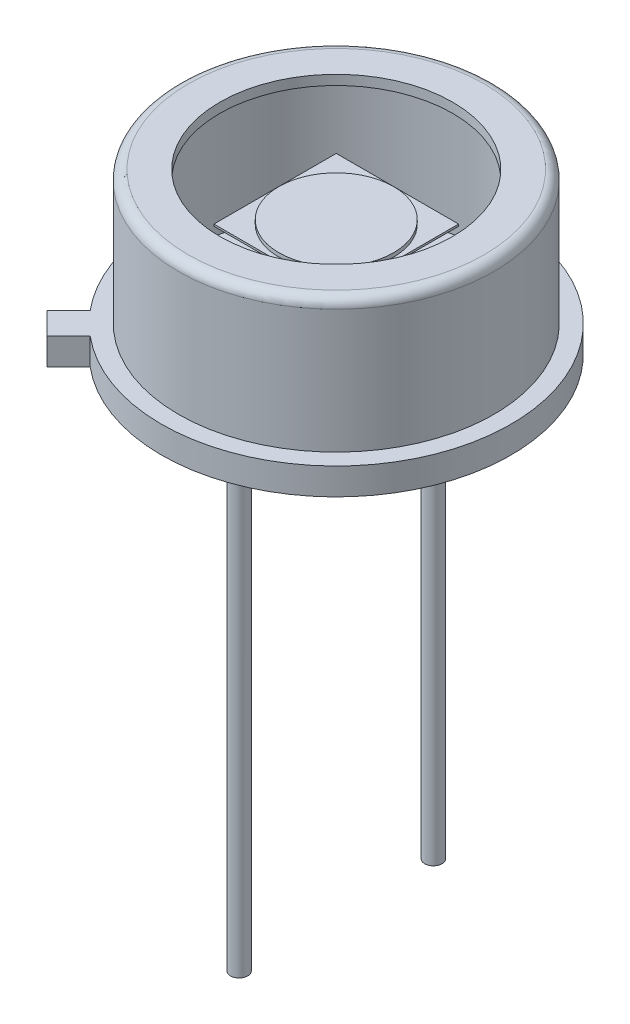
ISO-10303-21;
HEADER;
FILE_DESCRIPTION(('STEP AP214'),'2;1');
FILE_NAME('part.step','',(''),(''),'','','');
FILE_SCHEMA(('AUTOMOTIVE_DESIGN { 1 0 10303 214 1 1 1 1 }'));
ENDSEC;
DATA;
#1=APPLICATION_CONTEXT('core data for automotive mechanical design processes');
#2=APPLICATION_PROTOCOL_DEFINITION('international standard','automotive_design',2000,#1);
#3=PRODUCT_CONTEXT('',#1,'mechanical');
#4=PRODUCT('Part','Part','',(#3));
#5=PRODUCT_RELATED_PRODUCT_CATEGORY('part','',(#4));
#6=PRODUCT_DEFINITION_FORMATION('','',#4);
#7=PRODUCT_DEFINITION_CONTEXT('part definition',#1,'design');
#8=PRODUCT_DEFINITION('design','',#6,#7);
#9=PRODUCT_DEFINITION_SHAPE('','',#8);
#10=(LENGTH_UNIT() NAMED_UNIT(*) SI_UNIT(.MILLI.,.METRE.));
#11=(NAMED_UNIT(*) PLANE_ANGLE_UNIT() SI_UNIT($,.RADIAN.));
#12=(NAMED_UNIT(*) SI_UNIT($,.STERADIAN.) SOLID_ANGLE_UNIT());
#13=UNCERTAINTY_MEASURE_WITH_UNIT(LENGTH_MEASURE(1.E-05),#10,'distance_accuracy_value','');
#14=(GEOMETRIC_REPRESENTATION_CONTEXT(3) GLOBAL_UNCERTAINTY_ASSIGNED_CONTEXT((#13)) GLOBAL_UNIT_ASSIGNED_CONTEXT((#10,
#11,#12)) REPRESENTATION_CONTEXT('',''));
#15=CARTESIAN_POINT('',(0.,0.,0.));
#16=DIRECTION('',(0.,0.,1.));
#17=DIRECTION('',(1.,0.,0.));
#18=AXIS2_PLACEMENT_3D('',#15,#16,#17);
#19=CARTESIAN_POINT('',(-1.6,2.95,-1.6));
#20=DIRECTION('',(0.,-1.,0.));
#21=DIRECTION('',(0.,0.,-1.));
#22=AXIS2_PLACEMENT_3D('',#19,#20,#21);
#23=PLANE('',#22);
#24=DIRECTION('',(0.,0.,-1.));
#25=VECTOR('',#24,1.);
#26=CARTESIAN_POINT('',(-1.6,2.95,1.6));
#27=LINE('',#26,#25);
#28=CARTESIAN_POINT('',(-1.6,2.95,1.6));
#29=VERTEX_POINT('',#28);
#30=CARTESIAN_POINT('',(-1.6,2.95,-1.6));
#31=VERTEX_POINT('',#30);
#32=EDGE_CURVE('E114',#29,#31,#27,.T.);
#33=ORIENTED_EDGE('',*,*,#32,.F.);
#34=DIRECTION('',(-1.,0.,0.));
#35=VECTOR('',#34,1.);
#36=CARTESIAN_POINT('',(-1.6,2.95,1.6));
#37=LINE('',#36,#35);
#38=CARTESIAN_POINT('',(1.6,2.95,1.6));
#39=VERTEX_POINT('',#38);
#40=EDGE_CURVE('E87',#39,#29,#37,.T.);
#41=ORIENTED_EDGE('',*,*,#40,.F.);
#42=DIRECTION('',(0.,0.,1.));
#43=VECTOR('',#42,1.);
#44=CARTESIAN_POINT('',(1.6,2.95,1.6));
#45=LINE('',#44,#43);
#46=CARTESIAN_POINT('',(1.6,2.95,-1.6));
#47=VERTEX_POINT('',#46);
#48=EDGE_CURVE('E81',#47,#39,#45,.T.);
#49=ORIENTED_EDGE('',*,*,#48,.F.);
#50=DIRECTION('',(1.,0.,0.));
#51=VECTOR('',#50,1.);
#52=CARTESIAN_POINT('',(-1.6,2.95,-1.6));
#53=LINE('',#52,#51);
#54=EDGE_CURVE('E105',#31,#47,#53,.T.);
#55=ORIENTED_EDGE('',*,*,#54,.F.);
#56=EDGE_LOOP('',(#33,#41,#49,#55));
#57=FACE_BOUND('',#56,.T.);
#58=CARTESIAN_POINT('',(0.,2.95,0.));
#59=DIRECTION('',(0.,-1.,0.));
#60=DIRECTION('',(0.,0.,-1.));
#61=AXIS2_PLACEMENT_3D('',#58,#59,#60);
#62=CIRCLE('',#61,1.5);
#63=CARTESIAN_POINT('',(0.,2.95,-1.5));
#64=VERTEX_POINT('',#63);
#65=EDGE_CURVE('E12',#64,#64,#62,.F.);
#66=ORIENTED_EDGE('',*,*,#65,.F.);
#67=EDGE_LOOP('',(#66));
#68=FACE_BOUND('',#67,.T.);
#69=ADVANCED_FACE('F47',(#57,#68),#23,.F.);
#70=CARTESIAN_POINT('',(-1.6,2.9,1.6));
#71=DIRECTION('',(1.,0.,0.));
#72=DIRECTION('',(0.,0.,-1.));
#73=AXIS2_PLACEMENT_3D('',#70,#71,#72);
#74=PLANE('',#73);
#75=ORIENTED_EDGE('',*,*,#32,.T.);
#76=DIRECTION('',(0.,1.,0.));
#77=VECTOR('',#76,1.);
#78=CARTESIAN_POINT('',(-1.6,2.9,-1.6));
#79=LINE('',#78,#77);
#80=CARTESIAN_POINT('',(-1.6,2.9,-1.6));
#81=VERTEX_POINT('',#80);
#82=EDGE_CURVE('E56',#81,#31,#79,.T.);
#83=ORIENTED_EDGE('',*,*,#82,.F.);
#84=DIRECTION('',(0.,0.,-1.));
#85=VECTOR('',#84,1.);
#86=CARTESIAN_POINT('',(-1.6,2.9,1.6));
#87=LINE('',#86,#85);
#88=CARTESIAN_POINT('',(-1.6,2.9,1.6));
#89=VERTEX_POINT('',#88);
#90=EDGE_CURVE('E100',#89,#81,#87,.T.);
#91=ORIENTED_EDGE('',*,*,#90,.F.);
#92=DIRECTION('',(0.,1.,0.));
#93=VECTOR('',#92,1.);
#94=CARTESIAN_POINT('',(-1.6,2.9,1.6));
#95=LINE('',#94,#93);
#96=EDGE_CURVE('E110',#89,#29,#95,.T.);
#97=ORIENTED_EDGE('',*,*,#96,.T.);
#98=EDGE_LOOP('',(#75,#83,#91,#97));
#99=FACE_BOUND('',#98,.T.);
#100=ADVANCED_FACE('F49',(#99),#74,.F.);
#101=CARTESIAN_POINT('',(-1.6,2.9,-1.6));
#102=DIRECTION('',(0.,0.,1.));
#103=DIRECTION('',(1.,0.,0.));
#104=AXIS2_PLACEMENT_3D('',#101,#102,#103);
#105=PLANE('',#104);
#106=ORIENTED_EDGE('',*,*,#54,.T.);
#107=DIRECTION('',(0.,1.,0.));
#108=VECTOR('',#107,1.);
#109=CARTESIAN_POINT('',(1.6,2.9,-1.6));
#110=LINE('',#109,#108);
#111=CARTESIAN_POINT('',(1.6,2.9,-1.6));
#112=VERTEX_POINT('',#111);
#113=EDGE_CURVE('E103',#112,#47,#110,.T.);
#114=ORIENTED_EDGE('',*,*,#113,.F.);
#115=DIRECTION('',(1.,0.,0.));
#116=VECTOR('',#115,1.);
#117=CARTESIAN_POINT('',(-1.6,2.9,-1.6));
#118=LINE('',#117,#116);
#119=EDGE_CURVE('E95',#81,#112,#118,.T.);
#120=ORIENTED_EDGE('',*,*,#119,.F.);
#121=ORIENTED_EDGE('',*,*,#82,.T.);
#122=EDGE_LOOP('',(#106,#114,#120,#121));
#123=FACE_BOUND('',#122,.T.);
#124=ADVANCED_FACE('F104',(#123),#105,.F.);
#125=CARTESIAN_POINT('',(1.6,2.9,1.6));
#126=DIRECTION('',(-1.,0.,0.));
#127=DIRECTION('',(0.,0.,1.));
#128=AXIS2_PLACEMENT_3D('',#125,#126,#127);
#129=PLANE('',#128);
#130=ORIENTED_EDGE('',*,*,#48,.T.);
#131=DIRECTION('',(0.,1.,0.));
#132=VECTOR('',#131,1.);
#133=CARTESIAN_POINT('',(1.6,2.9,1.6));
#134=LINE('',#133,#132);
#135=CARTESIAN_POINT('',(1.6,2.9,1.6));
#136=VERTEX_POINT('',#135);
#137=EDGE_CURVE('E106',#136,#39,#134,.T.);
#138=ORIENTED_EDGE('',*,*,#137,.F.);
#139=DIRECTION('',(0.,0.,1.));
#140=VECTOR('',#139,1.);
#141=CARTESIAN_POINT('',(1.6,2.9,1.6));
#142=LINE('',#141,#140);
#143=EDGE_CURVE('E98',#112,#136,#142,.T.);
#144=ORIENTED_EDGE('',*,*,#143,.F.);
#145=ORIENTED_EDGE('',*,*,#113,.T.);
#146=EDGE_LOOP('',(#130,#138,#144,#145));
#147=FACE_BOUND('',#146,.T.);
#148=ADVANCED_FACE('F108',(#147),#129,.F.);
#149=CARTESIAN_POINT('',(-1.6,2.9,1.6));
#150=DIRECTION('',(0.,0.,-1.));
#151=DIRECTION('',(-1.,0.,0.));
#152=AXIS2_PLACEMENT_3D('',#149,#150,#151);
#153=PLANE('',#152);
#154=ORIENTED_EDGE('',*,*,#40,.T.);
#155=ORIENTED_EDGE('',*,*,#96,.F.);
#156=DIRECTION('',(-1.,0.,0.));
#157=VECTOR('',#156,1.);
#158=CARTESIAN_POINT('',(-1.6,2.9,1.6));
#159=LINE('',#158,#157);
#160=EDGE_CURVE('E64',#136,#89,#159,.T.);
#161=ORIENTED_EDGE('',*,*,#160,.F.);
#162=ORIENTED_EDGE('',*,*,#137,.T.);
#163=EDGE_LOOP('',(#154,#155,#161,#162));
#164=FACE_BOUND('',#163,.T.);
#165=ADVANCED_FACE('F141',(#164),#153,.F.);
#166=CARTESIAN_POINT('',(-1.6,2.9,-1.6));
#167=DIRECTION('',(0.,-1.,0.));
#168=DIRECTION('',(0.,0.,-1.));
#169=AXIS2_PLACEMENT_3D('',#166,#167,#168);
#170=PLANE('',#169);
#171=ORIENTED_EDGE('',*,*,#90,.T.);
#172=ORIENTED_EDGE('',*,*,#119,.T.);
#173=ORIENTED_EDGE('',*,*,#143,.T.);
#174=ORIENTED_EDGE('',*,*,#160,.T.);
#175=EDGE_LOOP('',(#171,#172,#173,#174));
#176=FACE_BOUND('',#175,.T.);
#177=ADVANCED_FACE('F96',(#176),#170,.T.);
#178=CARTESIAN_POINT('',(0.,3.05,0.));
#179=DIRECTION('',(0.,-1.,0.));
#180=DIRECTION('',(0.,0.,-1.));
#181=AXIS2_PLACEMENT_3D('',#178,#179,#180);
#182=CYLINDRICAL_SURFACE('',#181,1.5);
#183=CARTESIAN_POINT('',(0.,3.05,0.));
#184=DIRECTION('',(0.,1.,0.));
#185=DIRECTION('',(0.,0.,1.));
#186=AXIS2_PLACEMENT_3D('',#183,#184,#185);
#187=CIRCLE('',#186,1.5);
#188=CARTESIAN_POINT('',(0.,3.05,1.5));
#189=VERTEX_POINT('',#188);
#190=EDGE_CURVE('E117',#189,#189,#187,.T.);
#191=ORIENTED_EDGE('',*,*,#190,.F.);
#192=EDGE_LOOP('',(#191));
#193=FACE_BOUND('',#192,.T.);
#194=ORIENTED_EDGE('',*,*,#65,.T.);
#195=EDGE_LOOP('',(#194));
#196=FACE_BOUND('',#195,.T.);
#197=ADVANCED_FACE('F130',(#193,#196),#182,.T.);
#198=CARTESIAN_POINT('',(0.,3.05,0.));
#199=DIRECTION('',(0.,1.,0.));
#200=DIRECTION('',(0.,0.,1.));
#201=AXIS2_PLACEMENT_3D('',#198,#199,#200);
#202=PLANE('',#201);
#203=ORIENTED_EDGE('',*,*,#190,.T.);
#204=EDGE_LOOP('',(#203));
#205=FACE_BOUND('',#204,.T.);
#206=ADVANCED_FACE('F132',(#205),#202,.T.);
#207=CLOSED_SHELL('',(#69,#100,#124,#148,#165,#177,#197,#206));
#208=MANIFOLD_SOLID_BREP('B2',#207);
#209=CARTESIAN_POINT('',(4.57,0.,0.));
#210=DIRECTION('',(0.,1.,0.));
#211=DIRECTION('',(0.,0.,1.));
#212=AXIS2_PLACEMENT_3D('',#209,#210,#211);
#213=PLANE('',#212);
#214=CARTESIAN_POINT('',(0.,0.,2.54));
#215=DIRECTION('',(0.,1.,0.));
#216=DIRECTION('',(0.,0.,1.));
#217=AXIS2_PLACEMENT_3D('',#214,#215,#216);
#218=CIRCLE('',#217,0.225000000000001);
#219=CARTESIAN_POINT('',(0.,0.,2.765));
#220=VERTEX_POINT('',#219);
#221=EDGE_CURVE('E211',#220,#220,#218,.F.);
#222=ORIENTED_EDGE('',*,*,#221,.F.);
#223=EDGE_LOOP('',(#222));
#224=FACE_BOUND('',#223,.T.);
#225=CARTESIAN_POINT('',(0.,0.,0.));
#226=DIRECTION('',(0.,-1.,0.));
#227=DIRECTION('',(0.,0.,-1.));
#228=AXIS2_PLACEMENT_3D('',#225,#226,#227);
#229=CIRCLE('',#228,4.57);
#230=CARTESIAN_POINT('',(-3.50514159586745,0.,2.93238510310631));
#231=VERTEX_POINT('',#230);
#232=CARTESIAN_POINT('',(-2.93238510310635,0.,3.50514159586742));
#233=VERTEX_POINT('',#232);
#234=EDGE_CURVE('E218',#231,#233,#229,.T.);
#235=ORIENTED_EDGE('',*,*,#234,.T.);
#236=DIRECTION('',(0.707106781186552,0.,-0.707106781186543));
#237=VECTOR('',#236,1.);
#238=CARTESIAN_POINT('',(0.286378246380551,0.,0.286378246380554));
#239=LINE('',#238,#237);
#240=CARTESIAN_POINT('',(-3.49807052805559,0.,4.07082702081665));
#241=VERTEX_POINT('',#240);
#242=EDGE_CURVE('E268',#241,#233,#239,.T.);
#243=ORIENTED_EDGE('',*,*,#242,.F.);
#244=DIRECTION('',(-0.707106781186543,0.,-0.707106781186552));
#245=VECTOR('',#244,1.);
#246=CARTESIAN_POINT('',(-3.78444877443613,0.,3.78444877443609));
#247=LINE('',#246,#245);
#248=CARTESIAN_POINT('',(-4.07082702081668,0.,3.49807052805554));
#249=VERTEX_POINT('',#248);
#250=EDGE_CURVE('E262',#241,#249,#247,.T.);
#251=ORIENTED_EDGE('',*,*,#250,.T.);
#252=DIRECTION('',(0.707106781186552,0.,-0.707106781186543));
#253=VECTOR('',#252,1.);
#254=CARTESIAN_POINT('',(-0.286378246380548,0.,-0.286378246380552));
#255=LINE('',#254,#253);
#256=EDGE_CURVE('E260',#249,#231,#255,.T.);
#257=ORIENTED_EDGE('',*,*,#256,.T.);
#258=EDGE_LOOP('',(#235,#243,#251,#257));
#259=FACE_BOUND('',#258,.T.);
#260=CARTESIAN_POINT('',(0.,0.,-2.54));
#261=DIRECTION('',(0.,1.,0.));
#262=DIRECTION('',(0.,0.,1.));
#263=AXIS2_PLACEMENT_3D('',#260,#261,#262);
#264=CIRCLE('',#263,0.225000000000001);
#265=CARTESIAN_POINT('',(0.,0.,-2.315));
#266=VERTEX_POINT('',#265);
#267=EDGE_CURVE('E296',#266,#266,#264,.F.);
#268=ORIENTED_EDGE('',*,*,#267,.F.);
#269=EDGE_LOOP('',(#268));
#270=FACE_BOUND('',#269,.T.);
#271=CARTESIAN_POINT('',(0.,0.,-3.8));
#272=DIRECTION('',(0.,1.,0.));
#273=DIRECTION('',(0.,0.,1.));
#274=AXIS2_PLACEMENT_3D('',#271,#272,#273);
#275=CIRCLE('',#274,0.5);
#276=CARTESIAN_POINT('',(0.,0.,-3.3));
#277=VERTEX_POINT('',#276);
#278=EDGE_CURVE('E45',#277,#277,#275,.F.);
#279=ORIENTED_EDGE('',*,*,#278,.F.);
#280=EDGE_LOOP('',(#279));
#281=FACE_BOUND('',#280,.T.);
#282=ADVANCED_FACE('F203',(#224,#259,#270,#281),#213,.F.);
#283=CARTESIAN_POINT('',(3.871,4.19,0.));
#284=DIRECTION('',(0.,1.,0.));
#285=DIRECTION('',(0.,0.,1.));
#286=AXIS2_PLACEMENT_3D('',#283,#284,#285);
#287=PLANE('',#286);
#288=CARTESIAN_POINT('',(0.,4.19,0.));
#289=DIRECTION('',(0.,-1.,0.));
#290=DIRECTION('',(0.,0.,-1.));
#291=AXIS2_PLACEMENT_3D('',#288,#289,#290);
#292=CIRCLE('',#291,3.045);
#293=CARTESIAN_POINT('',(0.,4.19,-3.045));
#294=VERTEX_POINT('',#293);
#295=EDGE_CURVE('E293',#294,#294,#292,.T.);
#296=ORIENTED_EDGE('',*,*,#295,.T.);
#297=EDGE_LOOP('',(#296));
#298=FACE_BOUND('',#297,.T.);
#299=CARTESIAN_POINT('',(0.,4.19,0.));
#300=DIRECTION('',(0.,-1.,0.));
#301=DIRECTION('',(0.,0.,-1.));
#302=AXIS2_PLACEMENT_3D('',#299,#300,#301);
#303=CIRCLE('',#302,3.871);
#304=CARTESIAN_POINT('',(0.,4.19,-3.871));
#305=VERTEX_POINT('',#304);
#306=EDGE_CURVE('E278',#305,#305,#303,.T.);
#307=ORIENTED_EDGE('',*,*,#306,.F.);
#308=EDGE_LOOP('',(#307));
#309=FACE_BOUND('',#308,.T.);
#310=ADVANCED_FACE('F205',(#298,#309),#287,.T.);
#311=CARTESIAN_POINT('',(0.,0.,0.));
#312=DIRECTION('',(0.,-1.,0.));
#313=DIRECTION('',(0.,0.,-1.));
#314=AXIS2_PLACEMENT_3D('',#311,#312,#313);
#315=CYLINDRICAL_SURFACE('',#314,3.045);
#316=ORIENTED_EDGE('',*,*,#295,.F.);
#317=EDGE_LOOP('',(#316));
#318=FACE_BOUND('',#317,.T.);
#319=CARTESIAN_POINT('',(0.,3.936,0.));
#320=DIRECTION('',(0.,-1.,0.));
#321=DIRECTION('',(0.,0.,-1.));
#322=AXIS2_PLACEMENT_3D('',#319,#320,#321);
#323=CIRCLE('',#322,3.045);
#324=CARTESIAN_POINT('',(0.,3.936,-3.045));
#325=VERTEX_POINT('',#324);
#326=EDGE_CURVE('E290',#325,#325,#323,.T.);
#327=ORIENTED_EDGE('',*,*,#326,.T.);
#328=EDGE_LOOP('',(#327));
#329=FACE_BOUND('',#328,.T.);
#330=ADVANCED_FACE('F373',(#318,#329),#315,.F.);
#331=CARTESIAN_POINT('',(3.871,3.936,0.));
#332=DIRECTION('',(0.,1.,0.));
#333=DIRECTION('',(0.,0.,1.));
#334=AXIS2_PLACEMENT_3D('',#331,#332,#333);
#335=PLANE('',#334);
#336=ORIENTED_EDGE('',*,*,#326,.F.);
#337=EDGE_LOOP('',(#336));
#338=FACE_BOUND('',#337,.T.);
#339=CARTESIAN_POINT('',(0.,3.936,0.));
#340=DIRECTION('',(0.,-1.,0.));
#341=DIRECTION('',(0.,0.,-1.));
#342=AXIS2_PLACEMENT_3D('',#339,#340,#341);
#343=CIRCLE('',#342,3.871);
#344=CARTESIAN_POINT('',(0.,3.936,-3.871));
#345=VERTEX_POINT('',#344);
#346=EDGE_CURVE('E287',#345,#345,#343,.T.);
#347=ORIENTED_EDGE('',*,*,#346,.T.);
#348=EDGE_LOOP('',(#347));
#349=FACE_BOUND('',#348,.T.);
#350=ADVANCED_FACE('F370',(#338,#349),#335,.F.);
#351=CARTESIAN_POINT('',(0.,0.,0.));
#352=DIRECTION('',(0.,-1.,0.));
#353=DIRECTION('',(0.,0.,-1.));
#354=AXIS2_PLACEMENT_3D('',#351,#352,#353);
#355=CYLINDRICAL_SURFACE('',#354,3.871);
#356=ORIENTED_EDGE('',*,*,#346,.F.);
#357=EDGE_LOOP('',(#356));
#358=FACE_BOUND('',#357,.T.);
#359=CARTESIAN_POINT('',(0.,0.446,0.));
#360=DIRECTION('',(0.,1.,0.));
#361=DIRECTION('',(0.,0.,1.));
#362=AXIS2_PLACEMENT_3D('',#359,#360,#361);
#363=CIRCLE('',#362,3.871);
#364=CARTESIAN_POINT('',(0.,0.446,3.871));
#365=VERTEX_POINT('',#364);
#366=EDGE_CURVE('E275',#365,#365,#363,.F.);
#367=ORIENTED_EDGE('',*,*,#366,.T.);
#368=EDGE_LOOP('',(#367));
#369=FACE_BOUND('',#368,.T.);
#370=ADVANCED_FACE('F366',(#358,#369),#355,.F.);
#371=CARTESIAN_POINT('',(0.,0.,0.));
#372=DIRECTION('',(0.,-1.,0.));
#373=DIRECTION('',(0.,0.,-1.));
#374=AXIS2_PLACEMENT_3D('',#371,#372,#373);
#375=CYLINDRICAL_SURFACE('',#374,4.57);
#376=DIRECTION('',(0.,-1.,0.));
#377=VECTOR('',#376,1.);
#378=CARTESIAN_POINT('',(-3.50514159586745,2.30999999999999,2.93238510310631));
#379=LINE('',#378,#377);
#380=CARTESIAN_POINT('',(-3.50514159586745,0.7,2.93238510310631));
#381=VERTEX_POINT('',#380);
#382=EDGE_CURVE('E251',#381,#231,#379,.T.);
#383=ORIENTED_EDGE('',*,*,#382,.F.);
#384=CARTESIAN_POINT('',(0.,0.7,0.));
#385=DIRECTION('',(0.,-1.,0.));
#386=DIRECTION('',(0.,0.,-1.));
#387=AXIS2_PLACEMENT_3D('',#384,#385,#386);
#388=CIRCLE('',#387,4.57);
#389=CARTESIAN_POINT('',(-2.93238510310635,0.7,3.50514159586742));
#390=VERTEX_POINT('',#389);
#391=EDGE_CURVE('E242',#381,#390,#388,.T.);
#392=ORIENTED_EDGE('',*,*,#391,.T.);
#393=DIRECTION('',(0.,-1.,0.));
#394=VECTOR('',#393,1.);
#395=CARTESIAN_POINT('',(-2.93238510310635,2.30999999999999,3.50514159586742));
#396=LINE('',#395,#394);
#397=EDGE_CURVE('E223',#390,#233,#396,.T.);
#398=ORIENTED_EDGE('',*,*,#397,.T.);
#399=ORIENTED_EDGE('',*,*,#234,.F.);
#400=EDGE_LOOP('',(#383,#392,#398,#399));
#401=FACE_BOUND('',#400,.T.);
#402=ADVANCED_FACE('F252',(#401),#375,.T.);
#403=CARTESIAN_POINT('',(4.57,0.7,0.));
#404=DIRECTION('',(0.,1.,0.));
#405=DIRECTION('',(0.,0.,1.));
#406=AXIS2_PLACEMENT_3D('',#403,#404,#405);
#407=PLANE('',#406);
#408=CARTESIAN_POINT('',(0.,0.7,0.));
#409=DIRECTION('',(0.,-1.,0.));
#410=DIRECTION('',(0.,0.,-1.));
#411=AXIS2_PLACEMENT_3D('',#408,#409,#410);
#412=CIRCLE('',#411,4.125);
#413=CARTESIAN_POINT('',(0.,0.7,-4.125));
#414=VERTEX_POINT('',#413);
#415=EDGE_CURVE('E249',#414,#414,#412,.T.);
#416=ORIENTED_EDGE('',*,*,#415,.T.);
#417=EDGE_LOOP('',(#416));
#418=FACE_BOUND('',#417,.T.);
#419=ORIENTED_EDGE('',*,*,#391,.F.);
#420=DIRECTION('',(0.707106781186552,0.,-0.707106781186543));
#421=VECTOR('',#420,1.);
#422=CARTESIAN_POINT('',(-0.286378246380548,0.7,-0.286378246380552));
#423=LINE('',#422,#421);
#424=CARTESIAN_POINT('',(-4.07082702081668,0.7,3.49807052805554));
#425=VERTEX_POINT('',#424);
#426=EDGE_CURVE('E245',#425,#381,#423,.T.);
#427=ORIENTED_EDGE('',*,*,#426,.F.);
#428=DIRECTION('',(-0.707106781186543,0.,-0.707106781186552));
#429=VECTOR('',#428,1.);
#430=CARTESIAN_POINT('',(-3.78444877443613,0.7,3.78444877443609));
#431=LINE('',#430,#429);
#432=CARTESIAN_POINT('',(-3.49807052805559,0.7,4.07082702081665));
#433=VERTEX_POINT('',#432);
#434=EDGE_CURVE('E266',#433,#425,#431,.T.);
#435=ORIENTED_EDGE('',*,*,#434,.F.);
#436=DIRECTION('',(0.707106781186552,0.,-0.707106781186543));
#437=VECTOR('',#436,1.);
#438=CARTESIAN_POINT('',(0.286378246380551,0.7,0.286378246380554));
#439=LINE('',#438,#437);
#440=EDGE_CURVE('E248',#433,#390,#439,.T.);
#441=ORIENTED_EDGE('',*,*,#440,.T.);
#442=EDGE_LOOP('',(#419,#427,#435,#441));
#443=FACE_BOUND('',#442,.T.);
#444=ADVANCED_FACE('F243',(#418,#443),#407,.T.);
#445=CARTESIAN_POINT('',(0.,0.,0.));
#446=DIRECTION('',(0.,-1.,0.));
#447=DIRECTION('',(0.,0.,-1.));
#448=AXIS2_PLACEMENT_3D('',#445,#446,#447);
#449=CYLINDRICAL_SURFACE('',#448,4.125);
#450=CARTESIAN_POINT('',(0.,3.936,0.));
#451=DIRECTION('',(0.,-1.,0.));
#452=DIRECTION('',(0.,0.,-1.));
#453=AXIS2_PLACEMENT_3D('',#450,#451,#452);
#454=CIRCLE('',#453,4.125);
#455=CARTESIAN_POINT('',(0.,3.936,-4.125));
#456=VERTEX_POINT('',#455);
#457=EDGE_CURVE('E281',#456,#456,#454,.T.);
#458=ORIENTED_EDGE('',*,*,#457,.T.);
#459=EDGE_LOOP('',(#458));
#460=FACE_BOUND('',#459,.T.);
#461=ORIENTED_EDGE('',*,*,#415,.F.);
#462=EDGE_LOOP('',(#461));
#463=FACE_BOUND('',#462,.T.);
#464=ADVANCED_FACE('F357',(#460,#463),#449,.T.);
#465=CARTESIAN_POINT('',(0.,3.936,0.));
#466=DIRECTION('',(0.,-1.,0.));
#467=DIRECTION('',(0.,0.,-1.));
#468=AXIS2_PLACEMENT_3D('',#465,#466,#467);
#469=TOROIDAL_SURFACE('',#468,3.871,0.254);
#470=ORIENTED_EDGE('',*,*,#306,.T.);
#471=EDGE_LOOP('',(#470));
#472=FACE_BOUND('',#471,.T.);
#473=ORIENTED_EDGE('',*,*,#457,.F.);
#474=EDGE_LOOP('',(#473));
#475=FACE_BOUND('',#474,.T.);
#476=ADVANCED_FACE('F353',(#472,#475),#469,.T.);
#477=CARTESIAN_POINT('',(4.57,0.446,0.));
#478=DIRECTION('',(0.,1.,0.));
#479=DIRECTION('',(0.,0.,1.));
#480=AXIS2_PLACEMENT_3D('',#477,#478,#479);
#481=PLANE('',#480);
#482=ORIENTED_EDGE('',*,*,#366,.F.);
#483=EDGE_LOOP('',(#482));
#484=FACE_BOUND('',#483,.T.);
#485=ADVANCED_FACE('F350',(#484),#481,.T.);
#486=CARTESIAN_POINT('',(-0.286378246380548,2.30999999999999,-0.286378246380552));
#487=DIRECTION('',(-0.707106781186543,0.,-0.707106781186552));
#488=DIRECTION('',(-0.707106781186552,0.,0.707106781186543));
#489=AXIS2_PLACEMENT_3D('',#486,#487,#488);
#490=PLANE('',#489);
#491=DIRECTION('',(0.,-1.,0.));
#492=VECTOR('',#491,1.);
#493=CARTESIAN_POINT('',(-4.07082702081668,2.30999999999999,3.49807052805554));
#494=LINE('',#493,#492);
#495=EDGE_CURVE('E259',#425,#249,#494,.T.);
#496=ORIENTED_EDGE('',*,*,#495,.F.);
#497=ORIENTED_EDGE('',*,*,#426,.T.);
#498=ORIENTED_EDGE('',*,*,#382,.T.);
#499=ORIENTED_EDGE('',*,*,#256,.F.);
#500=EDGE_LOOP('',(#496,#497,#498,#499));
#501=FACE_BOUND('',#500,.T.);
#502=ADVANCED_FACE('F258',(#501),#490,.T.);
#503=CARTESIAN_POINT('',(0.286378246380551,2.30999999999999,0.286378246380554));
#504=DIRECTION('',(-0.707106781186543,0.,-0.707106781186552));
#505=DIRECTION('',(-0.707106781186552,0.,0.707106781186543));
#506=AXIS2_PLACEMENT_3D('',#503,#504,#505);
#507=PLANE('',#506);
#508=ORIENTED_EDGE('',*,*,#440,.F.);
#509=DIRECTION('',(0.,-1.,0.));
#510=VECTOR('',#509,1.);
#511=CARTESIAN_POINT('',(-3.49807052805559,2.30999999999999,4.07082702081665));
#512=LINE('',#511,#510);
#513=EDGE_CURVE('E271',#433,#241,#512,.T.);
#514=ORIENTED_EDGE('',*,*,#513,.T.);
#515=ORIENTED_EDGE('',*,*,#242,.T.);
#516=ORIENTED_EDGE('',*,*,#397,.F.);
#517=EDGE_LOOP('',(#508,#514,#515,#516));
#518=FACE_BOUND('',#517,.T.);
#519=ADVANCED_FACE('F343',(#518),#507,.F.);
#520=CARTESIAN_POINT('',(-3.78444877443613,2.30999999999999,3.78444877443609));
#521=DIRECTION('',(-0.707106781186552,0.,0.707106781186543));
#522=DIRECTION('',(0.707106781186543,0.,0.707106781186552));
#523=AXIS2_PLACEMENT_3D('',#520,#521,#522);
#524=PLANE('',#523);
#525=ORIENTED_EDGE('',*,*,#513,.F.);
#526=ORIENTED_EDGE('',*,*,#434,.T.);
#527=ORIENTED_EDGE('',*,*,#495,.T.);
#528=ORIENTED_EDGE('',*,*,#250,.F.);
#529=EDGE_LOOP('',(#525,#526,#527,#528));
#530=FACE_BOUND('',#529,.T.);
#531=ADVANCED_FACE('F339',(#530),#524,.T.);
#532=CARTESIAN_POINT('',(0.,-12.7,-2.54));
#533=DIRECTION('',(0.,1.,0.));
#534=DIRECTION('',(0.,0.,1.));
#535=AXIS2_PLACEMENT_3D('',#532,#533,#534);
#536=CYLINDRICAL_SURFACE('',#535,0.225000000000001);
#537=CARTESIAN_POINT('',(0.,-12.7,-2.54));
#538=DIRECTION('',(0.,-1.,0.));
#539=DIRECTION('',(0.,0.,1.));
#540=AXIS2_PLACEMENT_3D('',#537,#538,#539);
#541=CIRCLE('',#540,0.225000000000001);
#542=CARTESIAN_POINT('',(0.,-12.7,-2.315));
#543=VERTEX_POINT('',#542);
#544=EDGE_CURVE('E270',#543,#543,#541,.T.);
#545=ORIENTED_EDGE('',*,*,#544,.F.);
#546=EDGE_LOOP('',(#545));
#547=FACE_BOUND('',#546,.T.);
#548=ORIENTED_EDGE('',*,*,#267,.T.);
#549=EDGE_LOOP('',(#548));
#550=FACE_BOUND('',#549,.T.);
#551=ADVANCED_FACE('F335',(#547,#550),#536,.T.);
#552=CARTESIAN_POINT('',(0.,-12.7,-2.54));
#553=DIRECTION('',(0.,1.,0.));
#554=DIRECTION('',(0.,0.,1.));
#555=AXIS2_PLACEMENT_3D('',#552,#553,#554);
#556=PLANE('',#555);
#557=ORIENTED_EDGE('',*,*,#544,.T.);
#558=EDGE_LOOP('',(#557));
#559=FACE_BOUND('',#558,.T.);
#560=ADVANCED_FACE('F331',(#559),#556,.F.);
#561=CARTESIAN_POINT('',(0.,-12.7,2.54));
#562=DIRECTION('',(0.,1.,0.));
#563=DIRECTION('',(0.,0.,1.));
#564=AXIS2_PLACEMENT_3D('',#561,#562,#563);
#565=CYLINDRICAL_SURFACE('',#564,0.225000000000001);
#566=CARTESIAN_POINT('',(0.,-12.7,2.54));
#567=DIRECTION('',(0.,-1.,0.));
#568=DIRECTION('',(0.,0.,-1.));
#569=AXIS2_PLACEMENT_3D('',#566,#567,#568);
#570=CIRCLE('',#569,0.225000000000001);
#571=CARTESIAN_POINT('',(0.,-12.7,2.315));
#572=VERTEX_POINT('',#571);
#573=EDGE_CURVE('E525',#572,#572,#570,.T.);
#574=ORIENTED_EDGE('',*,*,#573,.F.);
#575=EDGE_LOOP('',(#574));
#576=FACE_BOUND('',#575,.T.);
#577=ORIENTED_EDGE('',*,*,#221,.T.);
#578=EDGE_LOOP('',(#577));
#579=FACE_BOUND('',#578,.T.);
#580=ADVANCED_FACE('F301',(#576,#579),#565,.T.);
#581=CARTESIAN_POINT('',(0.,-12.7,2.54));
#582=DIRECTION('',(0.,-1.,0.));
#583=DIRECTION('',(0.,0.,-1.));
#584=AXIS2_PLACEMENT_3D('',#581,#582,#583);
#585=PLANE('',#584);
#586=ORIENTED_EDGE('',*,*,#573,.T.);
#587=EDGE_LOOP('',(#586));
#588=FACE_BOUND('',#587,.T.);
#589=ADVANCED_FACE('F316',(#588),#585,.T.);
#590=CARTESIAN_POINT('',(0.,-0.01,-3.8));
#591=DIRECTION('',(0.,1.,0.));
#592=DIRECTION('',(0.,0.,1.));
#593=AXIS2_PLACEMENT_3D('',#590,#591,#592);
#594=CYLINDRICAL_SURFACE('',#593,0.5);
#595=CARTESIAN_POINT('',(0.,-0.01,-3.8));
#596=DIRECTION('',(0.,-1.,0.));
#597=DIRECTION('',(0.,0.,-1.));
#598=AXIS2_PLACEMENT_3D('',#595,#596,#597);
#599=CIRCLE('',#598,0.5);
#600=CARTESIAN_POINT('',(0.,-0.01,-4.3));
#601=VERTEX_POINT('',#600);
#602=EDGE_CURVE('E528',#601,#601,#599,.T.);
#603=ORIENTED_EDGE('',*,*,#602,.F.);
#604=EDGE_LOOP('',(#603));
#605=FACE_BOUND('',#604,.T.);
#606=ORIENTED_EDGE('',*,*,#278,.T.);
#607=EDGE_LOOP('',(#606));
#608=FACE_BOUND('',#607,.T.);
#609=ADVANCED_FACE('F313',(#605,#608),#594,.T.);
#610=CARTESIAN_POINT('',(0.,-0.01,-3.8));
#611=DIRECTION('',(0.,-1.,0.));
#612=DIRECTION('',(0.,0.,-1.));
#613=AXIS2_PLACEMENT_3D('',#610,#611,#612);
#614=PLANE('',#613);
#615=ORIENTED_EDGE('',*,*,#602,.T.);
#616=EDGE_LOOP('',(#615));
#617=FACE_BOUND('',#616,.T.);
#618=ADVANCED_FACE('F315',(#617),#614,.T.);
#619=CLOSED_SHELL('',(#282,#310,#330,#350,#370,#402,#444,#464,#476,#485,#502,#519,#531,#551,
#560,#580,#589,#609,#618));
#620=MANIFOLD_SOLID_BREP('B6',#619);
#621=ADVANCED_BREP_SHAPE_REPRESENTATION('',(#18,#208,#620),#14);
#622=SHAPE_DEFINITION_REPRESENTATION(#9,#621);
ENDSEC;
END-ISO-10303-21;
